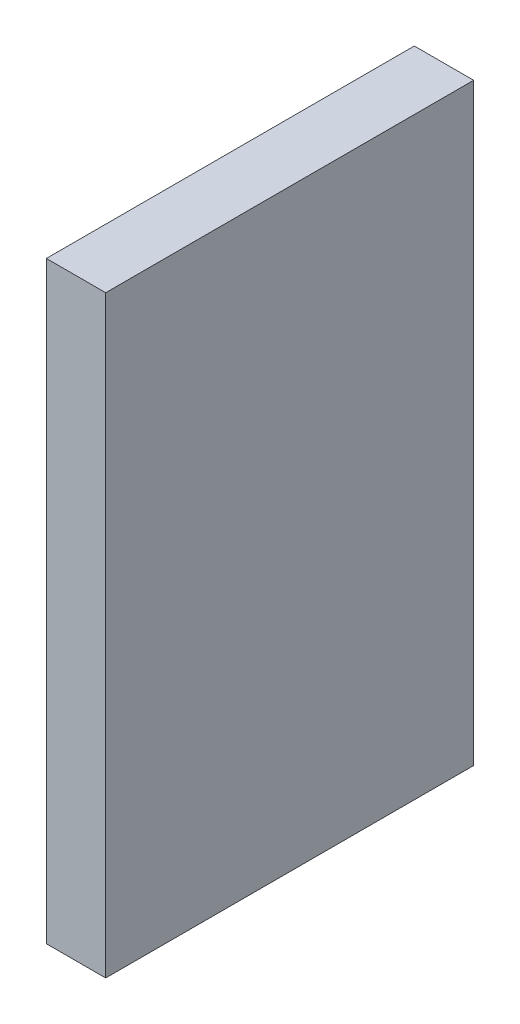
ISO-10303-21;
HEADER;
FILE_DESCRIPTION(('STEP AP214'),'2;1');
FILE_NAME('part.step','',(''),(''),'','','');
FILE_SCHEMA(('AUTOMOTIVE_DESIGN { 1 0 10303 214 1 1 1 1 }'));
ENDSEC;
DATA;
#1=APPLICATION_CONTEXT('core data for automotive mechanical design processes');
#2=APPLICATION_PROTOCOL_DEFINITION('international standard','automotive_design',2000,#1);
#3=PRODUCT_CONTEXT('',#1,'mechanical');
#4=PRODUCT('Part','Part','',(#3));
#5=PRODUCT_RELATED_PRODUCT_CATEGORY('part','',(#4));
#6=PRODUCT_DEFINITION_FORMATION('','',#4);
#7=PRODUCT_DEFINITION_CONTEXT('part definition',#1,'design');
#8=PRODUCT_DEFINITION('design','',#6,#7);
#9=PRODUCT_DEFINITION_SHAPE('','',#8);
#10=(LENGTH_UNIT() NAMED_UNIT(*) SI_UNIT(.MILLI.,.METRE.));
#11=(NAMED_UNIT(*) PLANE_ANGLE_UNIT() SI_UNIT($,.RADIAN.));
#12=(NAMED_UNIT(*) SI_UNIT($,.STERADIAN.) SOLID_ANGLE_UNIT());
#13=UNCERTAINTY_MEASURE_WITH_UNIT(LENGTH_MEASURE(1.E-05),#10,'distance_accuracy_value','');
#14=(GEOMETRIC_REPRESENTATION_CONTEXT(3) GLOBAL_UNCERTAINTY_ASSIGNED_CONTEXT((#13)) GLOBAL_UNIT_ASSIGNED_CONTEXT((#10,
#11,#12)) REPRESENTATION_CONTEXT('',''));
#15=CARTESIAN_POINT('',(0.,0.,0.));
#16=DIRECTION('',(0.,0.,1.));
#17=DIRECTION('',(1.,0.,0.));
#18=AXIS2_PLACEMENT_3D('',#15,#16,#17);
#19=CARTESIAN_POINT('',(3.,-14.2045238287724,8.90226191438617));
#20=DIRECTION('',(0.,1.,0.));
#21=DIRECTION('',(0.,0.,1.));
#22=AXIS2_PLACEMENT_3D('',#19,#20,#21);
#23=PLANE('',#22);
#24=DIRECTION('',(0.,0.,-1.));
#25=VECTOR('',#24,1.);
#26=CARTESIAN_POINT('',(0.,-14.2045238287724,8.90226191438617));
#27=LINE('',#26,#25);
#28=CARTESIAN_POINT('',(0.,-14.2045238287724,8.90226191438617));
#29=VERTEX_POINT('',#28);
#30=CARTESIAN_POINT('',(0.,-14.2045238287724,-9.69773808561383));
#31=VERTEX_POINT('',#30);
#32=EDGE_CURVE('E96',#29,#31,#27,.T.);
#33=ORIENTED_EDGE('',*,*,#32,.T.);
#34=DIRECTION('',(-1.,0.,0.));
#35=VECTOR('',#34,1.);
#36=CARTESIAN_POINT('',(3.,-14.2045238287724,-9.69773808561383));
#37=LINE('',#36,#35);
#38=CARTESIAN_POINT('',(3.,-14.2045238287724,-9.69773808561383));
#39=VERTEX_POINT('',#38);
#40=EDGE_CURVE('E11',#39,#31,#37,.T.);
#41=ORIENTED_EDGE('',*,*,#40,.F.);
#42=DIRECTION('',(0.,0.,-1.));
#43=VECTOR('',#42,1.);
#44=CARTESIAN_POINT('',(3.,-14.2045238287724,8.90226191438617));
#45=LINE('',#44,#43);
#46=CARTESIAN_POINT('',(3.,-14.2045238287724,8.90226191438617));
#47=VERTEX_POINT('',#46);
#48=EDGE_CURVE('E84',#47,#39,#45,.T.);
#49=ORIENTED_EDGE('',*,*,#48,.F.);
#50=DIRECTION('',(-1.,0.,0.));
#51=VECTOR('',#50,1.);
#52=CARTESIAN_POINT('',(3.,-14.2045238287724,8.90226191438617));
#53=LINE('',#52,#51);
#54=EDGE_CURVE('E92',#47,#29,#53,.T.);
#55=ORIENTED_EDGE('',*,*,#54,.T.);
#56=EDGE_LOOP('',(#33,#41,#49,#55));
#57=FACE_BOUND('',#56,.T.);
#58=ADVANCED_FACE('F33',(#57),#23,.F.);
#59=CARTESIAN_POINT('',(3.,-14.2045238287724,-9.69773808561383));
#60=DIRECTION('',(0.,0.,1.));
#61=DIRECTION('',(1.,0.,0.));
#62=AXIS2_PLACEMENT_3D('',#59,#60,#61);
#63=PLANE('',#62);
#64=DIRECTION('',(0.,1.,0.));
#65=VECTOR('',#64,1.);
#66=CARTESIAN_POINT('',(0.,-14.2045238287724,-9.69773808561383));
#67=LINE('',#66,#65);
#68=CARTESIAN_POINT('',(0.,15.7954761712276,-9.69773808561383));
#69=VERTEX_POINT('',#68);
#70=EDGE_CURVE('E88',#31,#69,#67,.T.);
#71=ORIENTED_EDGE('',*,*,#70,.T.);
#72=DIRECTION('',(-1.,0.,0.));
#73=VECTOR('',#72,1.);
#74=CARTESIAN_POINT('',(3.,15.7954761712276,-9.69773808561383));
#75=LINE('',#74,#73);
#76=CARTESIAN_POINT('',(3.,15.7954761712276,-9.69773808561383));
#77=VERTEX_POINT('',#76);
#78=EDGE_CURVE('E41',#77,#69,#75,.T.);
#79=ORIENTED_EDGE('',*,*,#78,.F.);
#80=DIRECTION('',(0.,1.,0.));
#81=VECTOR('',#80,1.);
#82=CARTESIAN_POINT('',(3.,-14.2045238287724,-9.69773808561383));
#83=LINE('',#82,#81);
#84=EDGE_CURVE('E79',#39,#77,#83,.T.);
#85=ORIENTED_EDGE('',*,*,#84,.F.);
#86=ORIENTED_EDGE('',*,*,#40,.T.);
#87=EDGE_LOOP('',(#71,#79,#85,#86));
#88=FACE_BOUND('',#87,.T.);
#89=ADVANCED_FACE('F87',(#88),#63,.F.);
#90=CARTESIAN_POINT('',(3.,15.7954761712276,-9.69773808561383));
#91=DIRECTION('',(0.,-1.,0.));
#92=DIRECTION('',(0.,0.,-1.));
#93=AXIS2_PLACEMENT_3D('',#90,#91,#92);
#94=PLANE('',#93);
#95=DIRECTION('',(0.,0.,1.));
#96=VECTOR('',#95,1.);
#97=CARTESIAN_POINT('',(0.,15.7954761712276,-9.69773808561383));
#98=LINE('',#97,#96);
#99=CARTESIAN_POINT('',(0.,15.7954761712276,8.90226191438617));
#100=VERTEX_POINT('',#99);
#101=EDGE_CURVE('E66',#69,#100,#98,.T.);
#102=ORIENTED_EDGE('',*,*,#101,.T.);
#103=DIRECTION('',(-1.,0.,0.));
#104=VECTOR('',#103,1.);
#105=CARTESIAN_POINT('',(3.,15.7954761712276,8.90226191438617));
#106=LINE('',#105,#104);
#107=CARTESIAN_POINT('',(3.,15.7954761712276,8.90226191438617));
#108=VERTEX_POINT('',#107);
#109=EDGE_CURVE('E89',#108,#100,#106,.T.);
#110=ORIENTED_EDGE('',*,*,#109,.F.);
#111=DIRECTION('',(0.,0.,1.));
#112=VECTOR('',#111,1.);
#113=CARTESIAN_POINT('',(3.,15.7954761712276,-9.69773808561383));
#114=LINE('',#113,#112);
#115=EDGE_CURVE('E82',#77,#108,#114,.T.);
#116=ORIENTED_EDGE('',*,*,#115,.F.);
#117=ORIENTED_EDGE('',*,*,#78,.T.);
#118=EDGE_LOOP('',(#102,#110,#116,#117));
#119=FACE_BOUND('',#118,.T.);
#120=ADVANCED_FACE('F90',(#119),#94,.F.);
#121=CARTESIAN_POINT('',(3.,15.7954761712276,8.90226191438617));
#122=DIRECTION('',(0.,0.,-1.));
#123=DIRECTION('',(-1.,0.,0.));
#124=AXIS2_PLACEMENT_3D('',#121,#122,#123);
#125=PLANE('',#124);
#126=DIRECTION('',(0.,-1.,0.));
#127=VECTOR('',#126,1.);
#128=CARTESIAN_POINT('',(0.,15.7954761712276,8.90226191438617));
#129=LINE('',#128,#127);
#130=EDGE_CURVE('E72',#100,#29,#129,.T.);
#131=ORIENTED_EDGE('',*,*,#130,.T.);
#132=ORIENTED_EDGE('',*,*,#54,.F.);
#133=DIRECTION('',(0.,-1.,0.));
#134=VECTOR('',#133,1.);
#135=CARTESIAN_POINT('',(3.,15.7954761712276,8.90226191438617));
#136=LINE('',#135,#134);
#137=EDGE_CURVE('E49',#108,#47,#136,.T.);
#138=ORIENTED_EDGE('',*,*,#137,.F.);
#139=ORIENTED_EDGE('',*,*,#109,.T.);
#140=EDGE_LOOP('',(#131,#132,#138,#139));
#141=FACE_BOUND('',#140,.T.);
#142=ADVANCED_FACE('F103',(#141),#125,.F.);
#143=CARTESIAN_POINT('',(3.,0.,0.));
#144=DIRECTION('',(1.,0.,0.));
#145=DIRECTION('',(0.,0.,-1.));
#146=AXIS2_PLACEMENT_3D('',#143,#144,#145);
#147=PLANE('',#146);
#148=ORIENTED_EDGE('',*,*,#48,.T.);
#149=ORIENTED_EDGE('',*,*,#84,.T.);
#150=ORIENTED_EDGE('',*,*,#115,.T.);
#151=ORIENTED_EDGE('',*,*,#137,.T.);
#152=EDGE_LOOP('',(#148,#149,#150,#151));
#153=FACE_BOUND('',#152,.T.);
#154=ADVANCED_FACE('F80',(#153),#147,.T.);
#155=CARTESIAN_POINT('',(0.,0.,0.));
#156=DIRECTION('',(1.,0.,0.));
#157=DIRECTION('',(0.,0.,-1.));
#158=AXIS2_PLACEMENT_3D('',#155,#156,#157);
#159=PLANE('',#158);
#160=ORIENTED_EDGE('',*,*,#32,.F.);
#161=ORIENTED_EDGE('',*,*,#130,.F.);
#162=ORIENTED_EDGE('',*,*,#101,.F.);
#163=ORIENTED_EDGE('',*,*,#70,.F.);
#164=EDGE_LOOP('',(#160,#161,#162,#163));
#165=FACE_BOUND('',#164,.T.);
#166=ADVANCED_FACE('F106',(#165),#159,.F.);
#167=CLOSED_SHELL('',(#58,#89,#120,#142,#154,#166));
#168=MANIFOLD_SOLID_BREP('B2',#167);
#169=ADVANCED_BREP_SHAPE_REPRESENTATION('',(#18,#168),#14);
#170=SHAPE_DEFINITION_REPRESENTATION(#9,#169);
ENDSEC;
END-ISO-10303-21;
